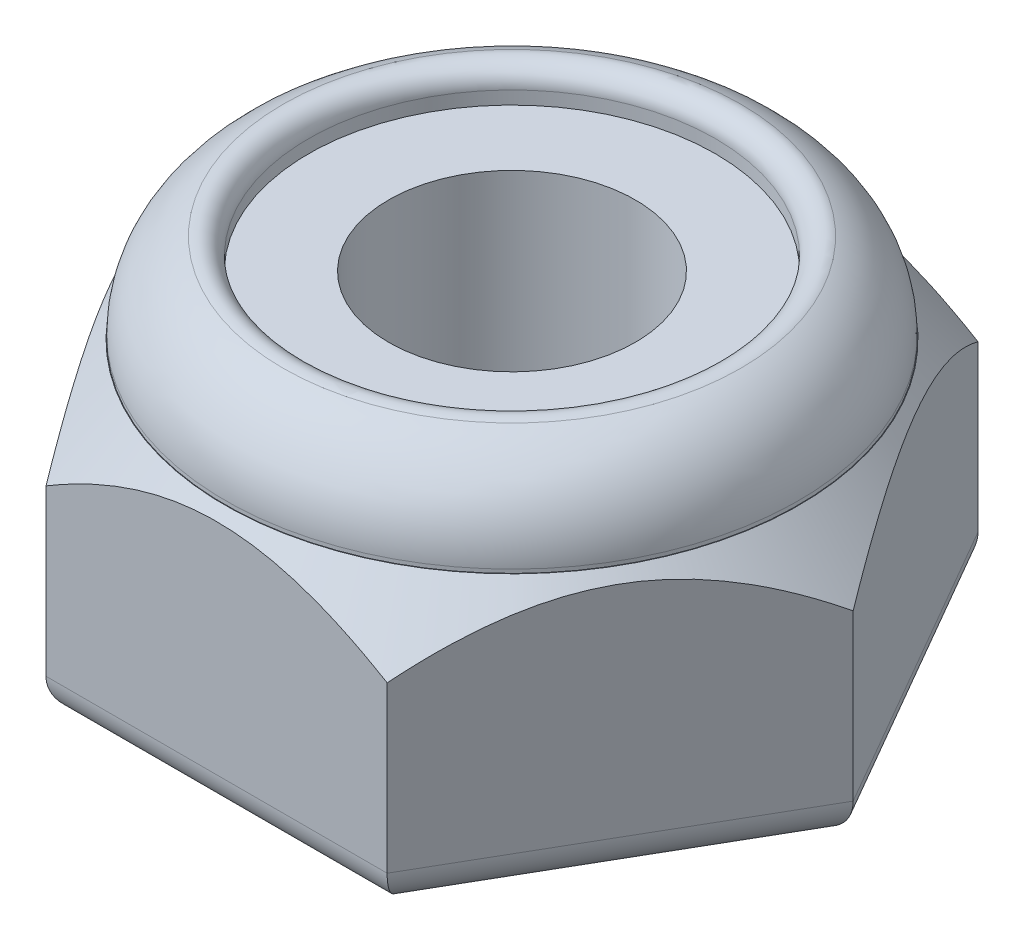
ISO-10303-21;
HEADER;
FILE_DESCRIPTION(('STEP AP214'),'2;1');
FILE_NAME('part.step','',(''),(''),'','','');
FILE_SCHEMA(('AUTOMOTIVE_DESIGN { 1 0 10303 214 1 1 1 1 }'));
ENDSEC;
DATA;
#1=APPLICATION_CONTEXT('core data for automotive mechanical design processes');
#2=APPLICATION_PROTOCOL_DEFINITION('international standard','automotive_design',2000,#1);
#3=PRODUCT_CONTEXT('',#1,'mechanical');
#4=PRODUCT('Part','Part','',(#3));
#5=PRODUCT_RELATED_PRODUCT_CATEGORY('part','',(#4));
#6=PRODUCT_DEFINITION_FORMATION('','',#4);
#7=PRODUCT_DEFINITION_CONTEXT('part definition',#1,'design');
#8=PRODUCT_DEFINITION('design','',#6,#7);
#9=PRODUCT_DEFINITION_SHAPE('','',#8);
#10=(LENGTH_UNIT() NAMED_UNIT(*) SI_UNIT(.MILLI.,.METRE.));
#11=(NAMED_UNIT(*) PLANE_ANGLE_UNIT() SI_UNIT($,.RADIAN.));
#12=(NAMED_UNIT(*) SI_UNIT($,.STERADIAN.) SOLID_ANGLE_UNIT());
#13=UNCERTAINTY_MEASURE_WITH_UNIT(LENGTH_MEASURE(1.E-05),#10,'distance_accuracy_value','');
#14=(GEOMETRIC_REPRESENTATION_CONTEXT(3) GLOBAL_UNCERTAINTY_ASSIGNED_CONTEXT((#13)) GLOBAL_UNIT_ASSIGNED_CONTEXT((#10,
#11,#12)) REPRESENTATION_CONTEXT('',''));
#15=CARTESIAN_POINT('',(0.,0.,0.));
#16=DIRECTION('',(0.,0.,1.));
#17=DIRECTION('',(1.,0.,0.));
#18=AXIS2_PLACEMENT_3D('',#15,#16,#17);
#19=CARTESIAN_POINT('',(0.,4.9784,0.));
#20=DIRECTION('',(0.,-1.,0.));
#21=DIRECTION('',(0.,0.,-1.));
#22=AXIS2_PLACEMENT_3D('',#19,#20,#21);
#23=CYLINDRICAL_SURFACE('',#22,3.937);
#24=CARTESIAN_POINT('',(0.,3.7084,0.));
#25=DIRECTION('',(0.,1.,0.));
#26=DIRECTION('',(0.,0.,-1.));
#27=AXIS2_PLACEMENT_3D('',#24,#25,#26);
#28=CIRCLE('',#27,3.937);
#29=CARTESIAN_POINT('',(0.,3.7084,-3.937));
#30=VERTEX_POINT('',#29);
#31=EDGE_CURVE('E320',#30,#30,#28,.T.);
#32=ORIENTED_EDGE('',*,*,#31,.F.);
#33=EDGE_LOOP('',(#32));
#34=FACE_BOUND('',#33,.T.);
#35=CARTESIAN_POINT('',(0.,3.6575999992,0.));
#36=DIRECTION('',(0.,-1.,0.));
#37=DIRECTION('',(0.,0.,-1.));
#38=AXIS2_PLACEMENT_3D('',#35,#36,#37);
#39=CIRCLE('',#38,3.937);
#40=CARTESIAN_POINT('',(0.,3.6575999992,-3.937));
#41=VERTEX_POINT('',#40);
#42=EDGE_CURVE('E20',#41,#41,#39,.F.);
#43=ORIENTED_EDGE('',*,*,#42,.T.);
#44=EDGE_LOOP('',(#43));
#45=FACE_BOUND('',#44,.T.);
#46=ADVANCED_FACE('F17',(#34,#45),#23,.T.);
#47=CARTESIAN_POINT('',(0.,3.7084,0.));
#48=DIRECTION('',(0.,1.,0.));
#49=DIRECTION('',(0.,0.,-1.));
#50=AXIS2_PLACEMENT_3D('',#47,#48,#49);
#51=TOROIDAL_SURFACE('',#50,2.667,1.27);
#52=ORIENTED_EDGE('',*,*,#31,.T.);
#53=EDGE_LOOP('',(#52));
#54=FACE_BOUND('',#53,.T.);
#55=CARTESIAN_POINT('',(0.,4.88572150982595,0.));
#56=DIRECTION('',(0.,-1.,0.));
#57=DIRECTION('',(0.,0.,1.));
#58=AXIS2_PLACEMENT_3D('',#55,#56,#57);
#59=CIRCLE('',#58,3.14324999999836);
#60=CARTESIAN_POINT('',(0.,4.88572150982595,3.14324999999836));
#61=VERTEX_POINT('',#60);
#62=EDGE_CURVE('E321',#61,#61,#59,.F.);
#63=ORIENTED_EDGE('',*,*,#62,.F.);
#64=EDGE_LOOP('',(#63));
#65=FACE_BOUND('',#64,.T.);
#66=ADVANCED_FACE('F135',(#54,#65),#51,.T.);
#67=CARTESIAN_POINT('',(2.34315,3.6576,4.05845484976));
#68=DIRECTION('',(0.,-1.,0.));
#69=DIRECTION('',(0.,0.,-1.));
#70=AXIS2_PLACEMENT_3D('',#67,#68,#69);
#71=PLANE('',#70);
#72=ORIENTED_EDGE('',*,*,#42,.F.);
#73=EDGE_LOOP('',(#72));
#74=FACE_BOUND('',#73,.T.);
#75=CARTESIAN_POINT('',(0.,3.65759999999682,0.));
#76=DIRECTION('',(0.,-1.,0.));
#77=DIRECTION('',(0.,0.,-1.));
#78=AXIS2_PLACEMENT_3D('',#75,#76,#77);
#79=CIRCLE('',#78,3.94407100941407);
#80=CARTESIAN_POINT('',(0.,3.65759999999682,-3.94407100941407));
#81=VERTEX_POINT('',#80);
#82=EDGE_CURVE('E120',#81,#81,#79,.T.);
#83=ORIENTED_EDGE('',*,*,#82,.F.);
#84=EDGE_LOOP('',(#83));
#85=FACE_BOUND('',#84,.T.);
#86=ADVANCED_FACE('F130',(#74,#85),#71,.F.);
#87=CARTESIAN_POINT('',(0.,4.65025720786,0.));
#88=DIRECTION('',(0.,-1.,0.));
#89=DIRECTION('',(0.,0.,1.));
#90=AXIS2_PLACEMENT_3D('',#87,#88,#89);
#91=TOROIDAL_SURFACE('',#90,3.048,0.254);
#92=CARTESIAN_POINT('',(0.,4.65025720786,0.));
#93=DIRECTION('',(0.,1.,0.));
#94=DIRECTION('',(0.,0.,1.));
#95=AXIS2_PLACEMENT_3D('',#92,#93,#94);
#96=CIRCLE('',#95,2.794);
#97=CARTESIAN_POINT('',(0.,4.65025720786,2.794));
#98=VERTEX_POINT('',#97);
#99=EDGE_CURVE('E105',#98,#98,#96,.F.);
#100=ORIENTED_EDGE('',*,*,#99,.T.);
#101=EDGE_LOOP('',(#100));
#102=FACE_BOUND('',#101,.T.);
#103=ORIENTED_EDGE('',*,*,#62,.T.);
#104=EDGE_LOOP('',(#103));
#105=FACE_BOUND('',#104,.T.);
#106=ADVANCED_FACE('F126',(#102,#105),#91,.T.);
#107=CARTESIAN_POINT('',(0.,2.76773860952062,0.));
#108=DIRECTION('',(0.,-1.,0.));
#109=DIRECTION('',(0.,0.,-1.));
#110=AXIS2_PLACEMENT_3D('',#107,#108,#109);
#111=CONICAL_SURFACE('',#110,4.69075337400682,0.698131700827581);
#112=CARTESIAN_POINT('',(-4.68629999991666,2.77304593410457,1.4434590500557E-10));
#113=CARTESIAN_POINT('',(-4.6517771713124,2.81418235899681,0.0597952933078886));
#114=CARTESIAN_POINT('',(-4.61695780278158,2.85432113120468,0.120104208690698));
#115=CARTESIAN_POINT('',(-4.54666264430625,2.93230661029137,0.241858994696012));
#116=CARTESIAN_POINT('',(-4.51118655183911,2.97015222469558,0.303305389303076));
#117=CARTESIAN_POINT('',(-4.40329561875201,3.08018701505636,0.490177967085855));
#118=CARTESIAN_POINT('',(-4.3298333399457,3.14837015580251,0.61741836641811));
#119=CARTESIAN_POINT('',(-4.17977964988124,3.27092778610743,0.877318981472815));
#120=CARTESIAN_POINT('',(-4.1031794392369,3.32525984886549,1.00999443817922));
#121=CARTESIAN_POINT('',(-3.94747591643516,3.41577217643516,1.27968085058917));
#122=CARTESIAN_POINT('',(-3.86837998236468,3.45200143009599,1.41667902707128));
#123=CARTESIAN_POINT('',(-3.73746585189115,3.493728112384,1.64342895248002));
#124=CARTESIAN_POINT('',(-3.68614686012057,3.50560413709795,1.73231605361984));
#125=CARTESIAN_POINT('',(-3.58316406700401,3.52008140696403,1.91068748360297));
#126=CARTESIAN_POINT('',(-3.53150020825549,3.52268106746167,2.00017191187044));
#127=CARTESIAN_POINT('',(-3.42855034541907,3.51847006516773,2.17848630493527));
#128=CARTESIAN_POINT('',(-3.37726380875734,3.51171021109729,2.26731719217758));
#129=CARTESIAN_POINT('',(-3.27519197698713,3.48921023545692,2.44411079082512));
#130=CARTESIAN_POINT('',(-3.22440670704505,3.47346966531413,2.53207345864086));
#131=CARTESIAN_POINT('',(-3.10963060122696,3.42817062210254,2.7308715054126));
#132=CARTESIAN_POINT('',(-3.04589899564457,3.39598542063136,2.84125788432917));
#133=CARTESIAN_POINT('',(-2.92018166725232,3.32004827830917,3.05900668449626));
#134=CARTESIAN_POINT('',(-2.85819691946939,3.27629001398473,3.16636741695058));
#135=CARTESIAN_POINT('',(-2.73588906813006,3.17910361367827,3.37821082963477));
#136=CARTESIAN_POINT('',(-2.67557364720568,3.12563730711488,3.48268020315565));
#137=CARTESIAN_POINT('',(-2.55683004301376,3.01104764586175,3.6883501586898));
#138=CARTESIAN_POINT('',(-2.49840123069798,2.94992687724908,3.7895518302466));
#139=CARTESIAN_POINT('',(-2.42439626075924,2.86741854603678,3.91773219819303));
#140=CARTESIAN_POINT('',(-2.40802320093963,2.84883596631722,3.94609116967594));
#141=CARTESIAN_POINT('',(-2.37546215758359,2.81125673899581,4.00248855111603));
#142=CARTESIAN_POINT('',(-2.35927376440876,2.79226151158477,4.03052767058773));
#143=CARTESIAN_POINT('',(-2.34315000000343,2.77304593401147,4.05845484974702));
#144=B_SPLINE_CURVE_WITH_KNOTS('',3,(#112,#113,#114,#115,#116,#117,#118,#119,#120,#121,#122,
#123,#124,#125,#126,#127,#128,#129,#130,#131,#132,#133,#134,#135,#136,#137,#138,#139,#140,#141,
#142,#143),.UNSPECIFIED.,.F.,.F.,(4,2,2,2,2,2,2,2,2,2,2,2,2,2,2,4),(0.,0.241096809071769,
0.482307589418999,0.967637153779526,1.4544359223224,1.93991010942664,2.24950193421383,
2.55914664314663,2.86711700063377,3.17510274211015,3.56882084711449,3.9627545240938,
4.35827201942639,4.75365624696984,4.86660838972883,4.97921936867768),.UNSPECIFIED.);
#145=CARTESIAN_POINT('',(-4.68629999995643,2.77304593405718,6.53656963999853E-11));
#146=VERTEX_POINT('',#145);
#147=CARTESIAN_POINT('',(-2.3431499999157,2.77304593405713,4.05845484975342));
#148=VERTEX_POINT('',#147);
#149=EDGE_CURVE('E92',#146,#148,#144,.T.);
#150=ORIENTED_EDGE('',*,*,#149,.T.);
#151=CARTESIAN_POINT('',(-2.34314999982787,2.77304593410268,4.05845484976));
#152=CARTESIAN_POINT('',(-2.27415972147602,2.81414935281112,4.05845484976));
#153=CARTESIAN_POINT('',(-2.20457738499326,2.85425669893359,4.05845484976));
#154=CARTESIAN_POINT('',(-2.06410193505854,2.93218331975122,4.05845484976));
#155=CARTESIAN_POINT('',(-1.99320821619297,2.97000150137744,4.05845484976));
#156=CARTESIAN_POINT('',(-1.77754688751654,3.07999086390864,4.05845484976));
#157=CARTESIAN_POINT('',(-1.63068545849823,3.14815894040016,4.05845484976001));
#158=CARTESIAN_POINT('',(-1.33052752439367,3.27077676919417,4.05845484975999));
#159=CARTESIAN_POINT('',(-1.17720631591642,3.32516696802971,4.05845484975996));
#160=CARTESIAN_POINT('',(-0.865613503651135,3.41574608762602,4.05845484976004));
#161=CARTESIAN_POINT('',(-0.707359229166658,3.45199244870592,4.05845484976014));
#162=CARTESIAN_POINT('',(-0.456822143233253,3.49192146540694,4.05845484975992));
#163=CARTESIAN_POINT('',(-0.365672921066384,3.50290887288614,4.05845484975977));
#164=CARTESIAN_POINT('',(-0.183016321959285,3.51758027905892,4.05845484976023));
#165=CARTESIAN_POINT('',(-0.0915105175025023,3.52128341029266,4.05845484976084));
#166=CARTESIAN_POINT('',(0.104649468639937,3.52128177484029,4.05845484976094));
#167=CARTESIAN_POINT('',(0.209305100869069,3.51643705325766,4.05845484976025));
#168=CARTESIAN_POINT('',(0.417787181904294,3.49730239552369,4.05845484975975));
#169=CARTESIAN_POINT('',(0.52161318134613,3.48300765103988,4.05845484975994));
#170=CARTESIAN_POINT('',(0.728332544904505,3.44553375878898,4.05845484976007));
#171=CARTESIAN_POINT('',(0.831215331548374,3.42229697717018,4.05845484976002));
#172=CARTESIAN_POINT('',(1.03487580389909,3.36791830047904,4.05845484975999));
#173=CARTESIAN_POINT('',(1.1356528946751,3.33677420315167,4.05845484976));
#174=CARTESIAN_POINT('',(1.33273383820699,3.26838741911988,4.05845484976001));
#175=CARTESIAN_POINT('',(1.42908716224489,3.23128582678808,4.05845484976));
#176=CARTESIAN_POINT('',(1.6194729170663,3.15151071586684,4.05845484976));
#177=CARTESIAN_POINT('',(1.71350470708075,3.10883567894396,4.05845484976));
#178=CARTESIAN_POINT('',(1.89803195380597,3.01941532327227,4.05845484976));
#179=CARTESIAN_POINT('',(1.98855798044621,2.97273255721912,4.05845484976));
#180=CARTESIAN_POINT('',(2.16742834956338,2.87556944080918,4.05845484976));
#181=CARTESIAN_POINT('',(2.25577492890631,2.82509321929021,4.05845484976));
#182=CARTESIAN_POINT('',(2.34315000003749,2.7730459339646,4.05845484976));
#183=B_SPLINE_CURVE_WITH_KNOTS('',3,(#151,#152,#153,#154,#155,#156,#157,#158,#159,#160,#161,
#162,#163,#164,#165,#166,#167,#168,#169,#170,#171,#172,#173,#174,#175,#176,#177,#178,#179,#180,
#181,#182),.UNSPECIFIED.,.F.,.F.,(4,2,2,2,2,2,2,2,2,2,2,2,2,2,2,4),(0.,0.240903303540453,
0.48192074469848,0.967059466894678,1.4542606836375,1.93990959161982,2.21507934673806,
2.48952538360679,2.80337599567293,3.11738642330865,3.43345557942433,3.74961286025032,
4.05916118076243,4.36879400588816,4.67425708514019,4.97939238035736),.UNSPECIFIED.);
#184=CARTESIAN_POINT('',(2.34315000000956,2.77304593396416,4.05845484977656));
#185=VERTEX_POINT('',#184);
#186=EDGE_CURVE('E84',#148,#185,#183,.T.);
#187=ORIENTED_EDGE('',*,*,#186,.T.);
#188=CARTESIAN_POINT('',(2.34314999997386,2.77304593396055,4.05845484978657));
#189=CARTESIAN_POINT('',(2.37767282858503,2.81418235886132,3.99865955662288));
#190=CARTESIAN_POINT('',(2.41249219712023,2.85432113107636,3.93835064123749));
#191=CARTESIAN_POINT('',(2.48278735560205,2.93230661017604,3.8165958552247));
#192=CARTESIAN_POINT('',(2.51826344807131,2.97015222458605,3.75514946061274));
#193=CARTESIAN_POINT('',(2.62615438116569,3.08018701496448,3.56827688281535));
#194=CARTESIAN_POINT('',(2.69961665997799,3.1483701557225,3.44103648347369));
#195=CARTESIAN_POINT('',(2.84967035005481,3.27092778604961,3.18113586839831));
#196=CARTESIAN_POINT('',(2.92627056070551,3.32525984881795,3.0484604116806));
#197=CARTESIAN_POINT('',(3.08197408352079,3.41577217640543,2.77877399924704));
#198=CARTESIAN_POINT('',(3.16107001759841,3.45200143007382,2.64177582275261));
#199=CARTESIAN_POINT('',(3.29198414807874,3.49372811236919,2.41502589733214));
#200=CARTESIAN_POINT('',(3.34330313984876,3.50560413708506,2.32613879619329));
#201=CARTESIAN_POINT('',(3.44628593296427,3.5200814069551,2.14776736621195));
#202=CARTESIAN_POINT('',(3.49794979171233,3.52268106745478,2.05828293794531));
#203=CARTESIAN_POINT('',(3.60089965454782,3.51847006516492,1.87996854488208));
#204=CARTESIAN_POINT('',(3.65218619120909,3.51171021109652,1.79113765764055));
#205=CARTESIAN_POINT('',(3.75425802297848,3.48921023546019,1.61434405899444));
#206=CARTESIAN_POINT('',(3.80504329292019,3.47346966531939,1.52638139117934));
#207=CARTESIAN_POINT('',(3.91981939873543,3.42817062211299,1.32758334441255));
#208=CARTESIAN_POINT('',(3.98355100431538,3.39598542064542,1.21719696550019));
#209=CARTESIAN_POINT('',(4.10926833270294,3.32004827833082,0.999448165341223));
#210=CARTESIAN_POINT('',(4.17125308048361,3.27629001401038,0.892087432890815));
#211=CARTESIAN_POINT('',(4.29356093181863,3.17910361371205,0.68024402021408));
#212=CARTESIAN_POINT('',(4.35387635274097,3.12563730715277,0.575774646696749));
#213=CARTESIAN_POINT('',(4.47261995692888,3.01104764590792,0.37010469116954));
#214=CARTESIAN_POINT('',(4.53104876924271,2.94992687729942,0.268903019616131));
#215=CARTESIAN_POINT('',(4.60505373919433,2.86741854607534,0.140722651647388));
#216=CARTESIAN_POINT('',(4.62142679902862,2.84883596633937,0.112363680139043));
#217=CARTESIAN_POINT('',(4.65398784241369,2.81125673898439,0.0559662986486696));
#218=CARTESIAN_POINT('',(4.67017623560288,2.79226151155619,0.0279271791521165));
#219=CARTESIAN_POINT('',(4.68630000002244,2.77304593396535,-3.18227229899157E-11));
#220=B_SPLINE_CURVE_WITH_KNOTS('',3,(#188,#189,#190,#191,#192,#193,#194,#195,#196,#197,#198,
#199,#200,#201,#202,#203,#204,#205,#206,#207,#208,#209,#210,#211,#212,#213,#214,#215,#216,#217,
#218,#219),.UNSPECIFIED.,.F.,.F.,(4,2,2,2,2,2,2,2,2,2,2,2,2,2,2,4),(0.,0.241096809094008,
0.482307589463435,0.967637153869262,1.45443592245891,1.9399101096095,2.249501934394,
2.55914664332411,2.86711700080813,3.17510274228139,3.56882084726899,3.96275452423153,
4.35827201954788,4.75365624707513,4.86660838993504,4.97921936898417),.UNSPECIFIED.);
#221=CARTESIAN_POINT('',(4.68629999998953,2.77304593400457,-5.35825234191027E-11));
#222=VERTEX_POINT('',#221);
#223=EDGE_CURVE('E89',#185,#222,#220,.T.);
#224=ORIENTED_EDGE('',*,*,#223,.T.);
#225=CARTESIAN_POINT('',(4.6863000000114,2.77304593396376,3.86937306649356E-11));
#226=CARTESIAN_POINT('',(4.65177717141053,2.81418235886461,-0.0597952931309419));
#227=CARTESIAN_POINT('',(4.61695780287969,2.8543211310797,-0.120104208518857));
#228=CARTESIAN_POINT('',(4.54666264440115,2.93230661017948,-0.241858994533567));
#229=CARTESIAN_POINT('',(4.51118655193082,2.97015222458953,-0.303305389144923));
#230=CARTESIAN_POINT('',(4.40329561883467,3.08018701496808,-0.49017796694135));
#231=CARTESIAN_POINT('',(4.3298333400232,3.14837015572619,-0.617418366283535));
#232=CARTESIAN_POINT('',(4.17977964994696,3.27092778605346,-0.877318981359357));
#233=CARTESIAN_POINT('',(4.103179439296,3.32525984882188,-1.00999443807697));
#234=CARTESIAN_POINT('',(3.9474759164805,3.41577217640948,-1.27968085051054));
#235=CARTESIAN_POINT('',(3.86837998240291,3.45200143007793,-1.41667902700506));
#236=CARTESIAN_POINT('',(3.73746585192262,3.49372811237334,-1.64342895242554));
#237=CARTESIAN_POINT('',(3.68614686015263,3.50560413708922,-1.73231605356432));
#238=CARTESIAN_POINT('',(3.58316406703719,3.52008140695928,-1.91068748354551));
#239=CARTESIAN_POINT('',(3.53150020828918,3.52268106745897,-2.00017191181209));
#240=CARTESIAN_POINT('',(3.42855034545377,3.51847006516913,-2.17848630487517));
#241=CARTESIAN_POINT('',(3.37726380879254,3.51171021110076,-2.26731719211663));
#242=CARTESIAN_POINT('',(3.27519197702322,3.48921023546447,-2.44411079076261));
#243=CARTESIAN_POINT('',(3.22440670708155,3.4734696653237,-2.53207345857764));
#244=CARTESIAN_POINT('',(3.10963060126643,3.42817062211737,-2.73087150534424));
#245=CARTESIAN_POINT('',(3.04589899568654,3.39598542064985,-2.8412578842565));
#246=CARTESIAN_POINT('',(2.9201816672991,3.32004827833537,-3.05900668441524));
#247=CARTESIAN_POINT('',(2.8581969195185,3.27629001401498,-3.16636741686554));
#248=CARTESIAN_POINT('',(2.73588906818359,3.17910361371677,-3.37821082954207));
#249=CARTESIAN_POINT('',(2.67557364726132,3.12563730715757,-3.4826802030593));
#250=CARTESIAN_POINT('',(2.55683004307352,3.01104764591286,-3.68835015858631));
#251=CARTESIAN_POINT('',(2.49840123075974,2.94992687730443,-3.78955183013963));
#252=CARTESIAN_POINT('',(2.42439626080767,2.86741854607986,-3.91773219810915));
#253=CARTESIAN_POINT('',(2.40802320097288,2.84883596634331,-3.94609116961837));
#254=CARTESIAN_POINT('',(2.37546215758681,2.81125673898716,-4.00248855111046));
#255=CARTESIAN_POINT('',(2.35927376439714,2.79226151155836,-4.03052767060787));
#256=CARTESIAN_POINT('',(2.34314999997709,2.7730459339669,-4.05845484979265));
#257=B_SPLINE_CURVE_WITH_KNOTS('',3,(#225,#226,#227,#228,#229,#230,#231,#232,#233,#234,#235,
#236,#237,#238,#239,#240,#241,#242,#243,#244,#245,#246,#247,#248,#249,#250,#251,#252,#253,#254,
#255,#256),.UNSPECIFIED.,.F.,.F.,(4,2,2,2,2,2,2,2,2,2,2,2,2,2,2,4),(0.,0.241096809094109,
0.482307589463635,0.967637153869672,1.45443592245954,1.93991010961035,2.24950193439461,
2.55914664332448,2.86711700080826,3.17510274228127,3.56882084726846,3.96275452423059,
4.35827201954654,4.7536562470734,4.86660838993678,4.97921936898936),.UNSPECIFIED.);
#258=CARTESIAN_POINT('',(2.34315000000696,2.7730459339659,-4.05845484977637));
#259=VERTEX_POINT('',#258);
#260=EDGE_CURVE('E194',#222,#259,#257,.T.);
#261=ORIENTED_EDGE('',*,*,#260,.T.);
#262=CARTESIAN_POINT('',(2.34315000003454,2.77304593396103,-4.05845484974981));
#263=CARTESIAN_POINT('',(2.27415972168534,2.81414935269011,-4.05845484975624));
#264=CARTESIAN_POINT('',(2.20457738520025,2.85425669882466,-4.05845484975897));
#265=CARTESIAN_POINT('',(2.06410193525636,2.93218331965835,-4.05845484976103));
#266=CARTESIAN_POINT('',(1.99320821638396,2.97000150128854,-4.05845484976036));
#267=CARTESIAN_POINT('',(1.77754688768886,3.07999086383284,-4.05845484975928));
#268=CARTESIAN_POINT('',(1.63068545865968,3.14815894033524,-4.05845484975981));
#269=CARTESIAN_POINT('',(1.33052752453078,3.27077676915049,-4.05845484976019));
#270=CARTESIAN_POINT('',(1.17720631604,3.32516696799627,-4.05845484976004));
#271=CARTESIAN_POINT('',(0.865613503745031,3.41574608760477,-4.05845484975996));
#272=CARTESIAN_POINT('',(0.707359229244379,3.45199244868657,-4.05845484976003));
#273=CARTESIAN_POINT('',(0.456822143285154,3.49192146539843,-4.05845484975999));
#274=CARTESIAN_POINT('',(0.365672921108244,3.50290887288314,-4.05845484975994));
#275=CARTESIAN_POINT('',(0.183016321980474,3.51758027906123,-4.05845484976006));
#276=CARTESIAN_POINT('',(0.0915105175130626,3.52128341029479,-4.05845484976022));
#277=CARTESIAN_POINT('',(-0.104649468639568,3.5212817748417,-4.05845484976025));
#278=CARTESIAN_POINT('',(-0.20930510086824,3.51643705325964,-4.05845484976007));
#279=CARTESIAN_POINT('',(-0.417787181902551,3.49730239552644,-4.05845484975993));
#280=CARTESIAN_POINT('',(-0.521613181343932,3.48300765104285,-4.05845484975998));
#281=CARTESIAN_POINT('',(-0.728332544901563,3.44553375879271,-4.05845484976002));
#282=CARTESIAN_POINT('',(-0.831215331545142,3.42229697717443,-4.05845484976001));
#283=CARTESIAN_POINT('',(-1.03487580389534,3.36791830048447,-4.05845484976));
#284=CARTESIAN_POINT('',(-1.13565289467112,3.33677420315773,-4.05845484976));
#285=CARTESIAN_POINT('',(-1.33273383819868,3.26838741912867,-4.05845484976));
#286=CARTESIAN_POINT('',(-1.42908716223255,3.23128582679923,-4.05845484976));
#287=CARTESIAN_POINT('',(-1.61947291704614,3.1515107158832,-4.05845484976));
#288=CARTESIAN_POINT('',(-1.71350470705681,3.10883567896316,-4.05845484976));
#289=CARTESIAN_POINT('',(-1.89803195377464,3.01941532329752,-4.05845484976));
#290=CARTESIAN_POINT('',(-1.98855798041127,2.97273255724758,-4.05845484976));
#291=CARTESIAN_POINT('',(-2.16742834952148,2.87556944084429,-4.05845484976));
#292=CARTESIAN_POINT('',(-2.25577492886105,2.82509321932877,-4.05845484976));
#293=CARTESIAN_POINT('',(-2.34314999998895,2.77304593400669,-4.05845484976));
#294=B_SPLINE_CURVE_WITH_KNOTS('',3,(#262,#263,#264,#265,#266,#267,#268,#269,#270,#271,#272,
#273,#274,#275,#276,#277,#278,#279,#280,#281,#282,#283,#284,#285,#286,#287,#288,#289,#290,#291,
#292,#293),.UNSPECIFIED.,.F.,.F.,(4,2,2,2,2,2,2,2,2,2,2,2,2,2,2,4),(0.,0.240903303564568,
0.481920744746104,0.967059466986234,1.45426068377659,1.93990959180789,2.21507934695801,
2.48952538385827,2.80337599592313,3.11738642355736,3.43345557967187,3.74961286049666,
4.05916118099498,4.36879400610686,4.67425708534489,4.97939238054819),.UNSPECIFIED.);
#295=CARTESIAN_POINT('',(-2.34315000003672,2.77304593405505,-4.05845484968556));
#296=VERTEX_POINT('',#295);
#297=EDGE_CURVE('E204',#259,#296,#294,.T.);
#298=ORIENTED_EDGE('',*,*,#297,.T.);
#299=CARTESIAN_POINT('',(-2.34315000008595,2.77304593410254,-4.05845484961112));
#300=CARTESIAN_POINT('',(-2.37767282869018,2.81418235899467,-3.99865955644765));
#301=CARTESIAN_POINT('',(-2.41249219722096,2.85432113120243,-3.9383506410649));
#302=CARTESIAN_POINT('',(-2.48278735569621,2.93230661028892,-3.81659585505972));
#303=CARTESIAN_POINT('',(-2.51826344816331,2.97015222469302,-3.75514946045272));
#304=CARTESIAN_POINT('',(-2.62615438125029,3.08018701505349,-3.56827688267016));
#305=CARTESIAN_POINT('',(-2.69961666005651,3.14837015579945,-3.44103648333806));
#306=CARTESIAN_POINT('',(-2.84967035012078,3.27092778610399,-3.18113586828368));
#307=CARTESIAN_POINT('',(-2.92627056076501,3.32525984886188,-3.04846041157745));
#308=CARTESIAN_POINT('',(-3.08197408356654,3.41577217643126,-2.77877399916788));
#309=CARTESIAN_POINT('',(-3.1610700176369,3.45200143009197,-2.64177582268597));
#310=CARTESIAN_POINT('',(-3.29198414811035,3.49372811237989,-2.41502589727738));
#311=CARTESIAN_POINT('',(-3.34330313988097,3.50560413709382,-2.32613879613749));
#312=CARTESIAN_POINT('',(-3.4462859329976,3.52008140695987,-2.14776736615423));
#313=CARTESIAN_POINT('',(-3.49794979174616,3.52268106745749,-2.05828293788671));
#314=CARTESIAN_POINT('',(-3.60089965458265,3.51847006516349,-1.87996854482175));
#315=CARTESIAN_POINT('',(-3.65218619124441,3.51171021109302,-1.79113765757938));
#316=CARTESIAN_POINT('',(-3.7542580230147,3.48921023545259,-1.61434405893171));
#317=CARTESIAN_POINT('',(-3.80504329295681,3.47346966530978,-1.52638139111591));
#318=CARTESIAN_POINT('',(-3.91981939877501,3.4281706220981,-1.327583344344));
#319=CARTESIAN_POINT('',(-3.98355100435746,3.39598542062686,-1.2171969654273));
#320=CARTESIAN_POINT('',(-4.10926833274984,3.32004827830454,-0.999448165259983));
#321=CARTESIAN_POINT('',(-4.17125308053284,3.27629001398003,-0.892087432805545));
#322=CARTESIAN_POINT('',(-4.2935609318723,3.17910361367342,-0.680244020121134));
#323=CARTESIAN_POINT('',(-4.35387635279674,3.12563730710995,-0.575774646600153));
#324=CARTESIAN_POINT('',(-4.47261995698877,3.01104764585666,-0.3701046910658));
#325=CARTESIAN_POINT('',(-4.53104876930462,2.94992687724391,-0.268903019508897));
#326=CARTESIAN_POINT('',(-4.60505373924291,2.86741854603208,-0.140722651563232));
#327=CARTESIAN_POINT('',(-4.62142679906203,2.84883596631308,-0.112363680081174));
#328=CARTESIAN_POINT('',(-4.6539878424171,2.81125673899282,-0.0559662986427702));
#329=CARTESIAN_POINT('',(-4.67017623559145,2.79226151158236,-0.0279271791719031));
#330=CARTESIAN_POINT('',(-4.6862999999963,2.77304593400966,-1.34435336237376E-11));
#331=B_SPLINE_CURVE_WITH_KNOTS('',3,(#299,#300,#301,#302,#303,#304,#305,#306,#307,#308,#309,
#310,#311,#312,#313,#314,#315,#316,#317,#318,#319,#320,#321,#322,#323,#324,#325,#326,#327,#328,
#329,#330),.UNSPECIFIED.,.F.,.F.,(4,2,2,2,2,2,2,2,2,2,2,2,2,2,2,4),(0.,0.241096809071417,
0.482307589418293,0.967637153778091,1.45443592232021,1.93991010942371,2.24950193421111,
2.55914664314412,2.86711700063149,3.17510274210808,3.56882084711286,3.96275452409262,
4.35827201942563,4.75365624696951,4.8666083897251,4.97921936867056),.UNSPECIFIED.);
#332=EDGE_CURVE('E252',#296,#146,#331,.T.);
#333=ORIENTED_EDGE('',*,*,#332,.T.);
#334=EDGE_LOOP('',(#150,#187,#224,#261,#298,#333));
#335=FACE_BOUND('',#334,.T.);
#336=ORIENTED_EDGE('',*,*,#82,.T.);
#337=EDGE_LOOP('',(#336));
#338=FACE_BOUND('',#337,.T.);
#339=ADVANCED_FACE('F86',(#335,#338),#111,.T.);
#340=CARTESIAN_POINT('',(0.,4.4704,0.));
#341=DIRECTION('',(0.,1.,0.));
#342=DIRECTION('',(0.,0.,1.));
#343=AXIS2_PLACEMENT_3D('',#340,#341,#342);
#344=CYLINDRICAL_SURFACE('',#343,2.794);
#345=ORIENTED_EDGE('',*,*,#99,.F.);
#346=EDGE_LOOP('',(#345));
#347=FACE_BOUND('',#346,.T.);
#348=CARTESIAN_POINT('',(0.,4.4704,0.));
#349=DIRECTION('',(0.,1.,0.));
#350=DIRECTION('',(0.,0.,1.));
#351=AXIS2_PLACEMENT_3D('',#348,#349,#350);
#352=CIRCLE('',#351,2.794);
#353=CARTESIAN_POINT('',(0.,4.4704,2.794));
#354=VERTEX_POINT('',#353);
#355=EDGE_CURVE('E202',#354,#354,#352,.T.);
#356=ORIENTED_EDGE('',*,*,#355,.F.);
#357=EDGE_LOOP('',(#356));
#358=FACE_BOUND('',#357,.T.);
#359=ADVANCED_FACE('F212',(#347,#358),#344,.F.);
#360=CARTESIAN_POINT('',(2.34315,3.6576,4.05845484976));
#361=DIRECTION('',(-0.866025403784329,0.,-0.50000000000019));
#362=DIRECTION('',(-0.50000000000019,0.,0.866025403784329));
#363=AXIS2_PLACEMENT_3D('',#360,#361,#362);
#364=PLANE('',#363);
#365=DIRECTION('',(-0.50000000000019,0.,0.866025403784329));
#366=VECTOR('',#365,1.);
#367=CARTESIAN_POINT('',(2.34315000000244,0.508,4.0584548497601));
#368=LINE('',#367,#366);
#369=CARTESIAN_POINT('',(4.68629999998101,0.508,-3.61285023998462E-11));
#370=VERTEX_POINT('',#369);
#371=CARTESIAN_POINT('',(2.34315000000125,0.508,4.05845484976));
#372=VERTEX_POINT('',#371);
#373=EDGE_CURVE('E244',#370,#372,#368,.T.);
#374=ORIENTED_EDGE('',*,*,#373,.F.);
#375=DIRECTION('',(0.,1.,0.));
#376=VECTOR('',#375,1.);
#377=CARTESIAN_POINT('',(4.68629999995656,3.6576,-7.52376863406847E-11));
#378=LINE('',#377,#376);
#379=EDGE_CURVE('E103',#370,#222,#378,.T.);
#380=ORIENTED_EDGE('',*,*,#379,.T.);
#381=ORIENTED_EDGE('',*,*,#223,.F.);
#382=DIRECTION('',(0.,1.,0.));
#383=VECTOR('',#382,1.);
#384=CARTESIAN_POINT('',(2.34315,3.6576,4.05845484976));
#385=LINE('',#384,#383);
#386=EDGE_CURVE('E96',#185,#372,#385,.F.);
#387=ORIENTED_EDGE('',*,*,#386,.T.);
#388=EDGE_LOOP('',(#374,#380,#381,#387));
#389=FACE_BOUND('',#388,.T.);
#390=ADVANCED_FACE('F100',(#389),#364,.F.);
#391=CARTESIAN_POINT('',(-2.34315,3.6576,4.05845484976));
#392=DIRECTION('',(0.,0.,-1.));
#393=DIRECTION('',(-1.,0.,0.));
#394=AXIS2_PLACEMENT_3D('',#391,#392,#393);
#395=PLANE('',#394);
#396=DIRECTION('',(-1.,0.,0.));
#397=VECTOR('',#396,1.);
#398=CARTESIAN_POINT('',(-2.34315,0.508,4.05845484976));
#399=LINE('',#398,#397);
#400=CARTESIAN_POINT('',(-2.34314999995443,0.508,4.05845484983513));
#401=VERTEX_POINT('',#400);
#402=EDGE_CURVE('E110',#372,#401,#399,.T.);
#403=ORIENTED_EDGE('',*,*,#402,.F.);
#404=ORIENTED_EDGE('',*,*,#386,.F.);
#405=ORIENTED_EDGE('',*,*,#186,.F.);
#406=DIRECTION('',(0.,1.,0.));
#407=VECTOR('',#406,1.);
#408=CARTESIAN_POINT('',(-2.3431499999095,3.6576,4.05845484990971));
#409=LINE('',#408,#407);
#410=EDGE_CURVE('E113',#148,#401,#409,.F.);
#411=ORIENTED_EDGE('',*,*,#410,.T.);
#412=EDGE_LOOP('',(#403,#404,#405,#411));
#413=FACE_BOUND('',#412,.T.);
#414=ADVANCED_FACE('F108',(#413),#395,.F.);
#415=CARTESIAN_POINT('',(-4.6863,3.6576,0.));
#416=DIRECTION('',(0.866025403784329,0.,-0.50000000000019));
#417=DIRECTION('',(-0.50000000000019,0.,-0.866025403784329));
#418=AXIS2_PLACEMENT_3D('',#415,#416,#417);
#419=PLANE('',#418);
#420=DIRECTION('',(-0.50000000000019,0.,-0.866025403784329));
#421=VECTOR('',#420,1.);
#422=CARTESIAN_POINT('',(-4.68630000000244,0.508,0.));
#423=LINE('',#422,#421);
#424=CARTESIAN_POINT('',(-4.68630000004847,0.508,7.36768637635624E-11));
#425=VERTEX_POINT('',#424);
#426=EDGE_CURVE('E284',#401,#425,#423,.T.);
#427=ORIENTED_EDGE('',*,*,#426,.F.);
#428=ORIENTED_EDGE('',*,*,#410,.F.);
#429=ORIENTED_EDGE('',*,*,#149,.F.);
#430=DIRECTION('',(0.,1.,0.));
#431=VECTOR('',#430,1.);
#432=CARTESIAN_POINT('',(-4.68630000009149,3.6576,1.51414471238898E-10));
#433=LINE('',#432,#431);
#434=EDGE_CURVE('E251',#146,#425,#433,.F.);
#435=ORIENTED_EDGE('',*,*,#434,.T.);
#436=EDGE_LOOP('',(#427,#428,#429,#435));
#437=FACE_BOUND('',#436,.T.);
#438=ADVANCED_FACE('F229',(#437),#419,.F.);
#439=CARTESIAN_POINT('',(-2.34315,3.6576,-4.05845484976));
#440=DIRECTION('',(0.866025403784329,0.,0.50000000000019));
#441=DIRECTION('',(0.50000000000019,0.,-0.866025403784329));
#442=AXIS2_PLACEMENT_3D('',#439,#440,#441);
#443=PLANE('',#442);
#444=DIRECTION('',(0.50000000000019,0.,-0.866025403784329));
#445=VECTOR('',#444,1.);
#446=CARTESIAN_POINT('',(-2.34315000000244,0.508,-4.0584548497601));
#447=LINE('',#446,#445);
#448=CARTESIAN_POINT('',(-2.34315000009125,0.508,-4.05845484976));
#449=VERTEX_POINT('',#448);
#450=EDGE_CURVE('E272',#425,#449,#447,.T.);
#451=ORIENTED_EDGE('',*,*,#450,.F.);
#452=ORIENTED_EDGE('',*,*,#434,.F.);
#453=ORIENTED_EDGE('',*,*,#332,.F.);
#454=DIRECTION('',(0.,1.,0.));
#455=VECTOR('',#454,1.);
#456=CARTESIAN_POINT('',(-2.34315000018,3.6576,-4.05845484976));
#457=LINE('',#456,#455);
#458=EDGE_CURVE('E201',#296,#449,#457,.F.);
#459=ORIENTED_EDGE('',*,*,#458,.T.);
#460=EDGE_LOOP('',(#451,#452,#453,#459));
#461=FACE_BOUND('',#460,.T.);
#462=ADVANCED_FACE('F261',(#461),#443,.F.);
#463=CARTESIAN_POINT('',(2.34315,3.6576,-4.05845484976));
#464=DIRECTION('',(0.,0.,1.));
#465=DIRECTION('',(1.,0.,0.));
#466=AXIS2_PLACEMENT_3D('',#463,#464,#465);
#467=PLANE('',#466);
#468=DIRECTION('',(1.,0.,0.));
#469=VECTOR('',#468,1.);
#470=CARTESIAN_POINT('',(2.34315,0.508,-4.05845484976));
#471=LINE('',#470,#469);
#472=CARTESIAN_POINT('',(2.34314999999769,0.508,-4.05845484975956));
#473=VERTEX_POINT('',#472);
#474=EDGE_CURVE('E302',#449,#473,#471,.T.);
#475=ORIENTED_EDGE('',*,*,#474,.F.);
#476=ORIENTED_EDGE('',*,*,#458,.F.);
#477=ORIENTED_EDGE('',*,*,#297,.F.);
#478=DIRECTION('',(0.,1.,0.));
#479=VECTOR('',#478,1.);
#480=CARTESIAN_POINT('',(2.34314999999695,3.6576,-4.05845484975824));
#481=LINE('',#480,#479);
#482=EDGE_CURVE('E200',#259,#473,#481,.F.);
#483=ORIENTED_EDGE('',*,*,#482,.T.);
#484=EDGE_LOOP('',(#475,#476,#477,#483));
#485=FACE_BOUND('',#484,.T.);
#486=ADVANCED_FACE('F189',(#485),#467,.F.);
#487=CARTESIAN_POINT('',(4.6863,3.6576,0.));
#488=DIRECTION('',(-0.866025403784329,0.,0.50000000000019));
#489=DIRECTION('',(0.50000000000019,0.,0.866025403784329));
#490=AXIS2_PLACEMENT_3D('',#487,#488,#489);
#491=PLANE('',#490);
#492=DIRECTION('',(0.50000000000019,0.,0.866025403784329));
#493=VECTOR('',#492,1.);
#494=CARTESIAN_POINT('',(4.68630000000244,0.508,0.));
#495=LINE('',#494,#493);
#496=EDGE_CURVE('E311',#473,#370,#495,.T.);
#497=ORIENTED_EDGE('',*,*,#496,.F.);
#498=ORIENTED_EDGE('',*,*,#482,.F.);
#499=ORIENTED_EDGE('',*,*,#260,.F.);
#500=ORIENTED_EDGE('',*,*,#379,.F.);
#501=EDGE_LOOP('',(#497,#498,#499,#500));
#502=FACE_BOUND('',#501,.T.);
#503=ADVANCED_FACE('F184',(#502),#491,.F.);
#504=CARTESIAN_POINT('',(0.,4.4704,0.));
#505=DIRECTION('',(0.,1.,0.));
#506=DIRECTION('',(0.,0.,1.));
#507=AXIS2_PLACEMENT_3D('',#504,#505,#506);
#508=PLANE('',#507);
#509=CARTESIAN_POINT('',(0.,4.47039999999,0.));
#510=DIRECTION('',(0.,1.,0.));
#511=DIRECTION('',(0.,0.,1.));
#512=AXIS2_PLACEMENT_3D('',#509,#510,#511);
#513=CIRCLE('',#512,1.69545);
#514=CARTESIAN_POINT('',(0.,4.47039999999,1.69545));
#515=VERTEX_POINT('',#514);
#516=EDGE_CURVE('E306',#515,#515,#513,.F.);
#517=ORIENTED_EDGE('',*,*,#516,.T.);
#518=EDGE_LOOP('',(#517));
#519=FACE_BOUND('',#518,.T.);
#520=ORIENTED_EDGE('',*,*,#355,.T.);
#521=EDGE_LOOP('',(#520));
#522=FACE_BOUND('',#521,.T.);
#523=ADVANCED_FACE('F180',(#519,#522),#508,.T.);
#524=CARTESIAN_POINT('',(1.90320909488,0.508,3.80445484976));
#525=DIRECTION('',(-0.50000000000019,0.,0.866025403784329));
#526=DIRECTION('',(0.866025403784329,0.,0.50000000000019));
#527=AXIS2_PLACEMENT_3D('',#524,#525,#526);
#528=CYLINDRICAL_SURFACE('',#527,0.508);
#529=CARTESIAN_POINT('',(2.04985606325424,0.508,3.55045484976));
#530=DIRECTION('',(-0.866025403784494,0.,0.499999999999905));
#531=DIRECTION('',(-0.499999999999905,0.,-0.866025403784494));
#532=AXIS2_PLACEMENT_3D('',#529,#530,#531);
#533=ELLIPSE('',#532,0.586587873496623,0.508);
#534=CARTESIAN_POINT('',(2.04985606375794,0.,3.55045485041748));
#535=VERTEX_POINT('',#534);
#536=EDGE_CURVE('E245',#535,#372,#533,.T.);
#537=ORIENTED_EDGE('',*,*,#536,.F.);
#538=DIRECTION('',(-0.499999999989813,0.,0.86602540379032));
#539=VECTOR('',#538,1.);
#540=CARTESIAN_POINT('',(4.0997121268,0.,9.29084066625396E-10));
#541=LINE('',#540,#539);
#542=CARTESIAN_POINT('',(4.09971212706719,0.,4.66302235539728E-10));
#543=VERTEX_POINT('',#542);
#544=EDGE_CURVE('E297',#543,#535,#541,.T.);
#545=ORIENTED_EDGE('',*,*,#544,.F.);
#546=CARTESIAN_POINT('',(4.09971212650779,0.508,3.52040445406043E-12));
#547=DIRECTION('',(0.,0.,1.));
#548=DIRECTION('',(1.,0.,0.));
#549=AXIS2_PLACEMENT_3D('',#546,#547,#548);
#550=ELLIPSE('',#549,0.586587873496734,0.508);
#551=EDGE_CURVE('E313',#370,#543,#550,.F.);
#552=ORIENTED_EDGE('',*,*,#551,.F.);
#553=ORIENTED_EDGE('',*,*,#373,.T.);
#554=EDGE_LOOP('',(#537,#545,#552,#553));
#555=FACE_BOUND('',#554,.T.);
#556=ADVANCED_FACE('F176',(#555),#528,.T.);
#557=CARTESIAN_POINT('',(-2.34315,0.508,3.55045484976));
#558=DIRECTION('',(-1.,0.,0.));
#559=DIRECTION('',(0.,0.,1.));
#560=AXIS2_PLACEMENT_3D('',#557,#558,#559);
#561=CYLINDRICAL_SURFACE('',#560,0.508);
#562=ORIENTED_EDGE('',*,*,#536,.T.);
#563=ORIENTED_EDGE('',*,*,#402,.T.);
#564=CARTESIAN_POINT('',(-2.04985606325017,0.508,3.55045484976));
#565=DIRECTION('',(-0.866025403784493,0.,-0.499999999999905));
#566=DIRECTION('',(0.499999999999905,0.,-0.866025403784493));
#567=AXIS2_PLACEMENT_3D('',#564,#565,#566);
#568=ELLIPSE('',#567,0.586587873496623,0.508);
#569=CARTESIAN_POINT('',(-2.04985606378386,0.,3.55045485031));
#570=VERTEX_POINT('',#569);
#571=EDGE_CURVE('E286',#570,#401,#568,.T.);
#572=ORIENTED_EDGE('',*,*,#571,.F.);
#573=DIRECTION('',(1.,0.,0.));
#574=VECTOR('',#573,1.);
#575=CARTESIAN_POINT('',(2.34315,0.,3.55045485031));
#576=LINE('',#575,#574);
#577=EDGE_CURVE('E294',#535,#570,#576,.F.);
#578=ORIENTED_EDGE('',*,*,#577,.F.);
#579=EDGE_LOOP('',(#562,#563,#572,#578));
#580=FACE_BOUND('',#579,.T.);
#581=ADVANCED_FACE('F172',(#580),#561,.T.);
#582=CARTESIAN_POINT('',(-4.24635909488,0.508,-0.254));
#583=DIRECTION('',(-0.50000000000019,0.,-0.866025403784329));
#584=DIRECTION('',(-0.866025403784329,0.,0.50000000000019));
#585=AXIS2_PLACEMENT_3D('',#582,#583,#584);
#586=CYLINDRICAL_SURFACE('',#585,0.508);
#587=ORIENTED_EDGE('',*,*,#571,.T.);
#588=ORIENTED_EDGE('',*,*,#426,.T.);
#589=CARTESIAN_POINT('',(-4.09971212650779,0.508,-3.52081102987511E-12));
#590=DIRECTION('',(0.,0.,-1.));
#591=DIRECTION('',(1.,0.,0.));
#592=AXIS2_PLACEMENT_3D('',#589,#590,#591);
#593=ELLIPSE('',#592,0.586587873496734,0.508);
#594=CARTESIAN_POINT('',(-4.09971212671078,0.,4.62781627797761E-10));
#595=VERTEX_POINT('',#594);
#596=EDGE_CURVE('E277',#595,#425,#593,.T.);
#597=ORIENTED_EDGE('',*,*,#596,.F.);
#598=DIRECTION('',(-0.499999999989813,0.,-0.86602540379032));
#599=VECTOR('',#598,1.);
#600=CARTESIAN_POINT('',(-2.049856064,0.,3.55045485031));
#601=LINE('',#600,#599);
#602=EDGE_CURVE('E296',#570,#595,#601,.T.);
#603=ORIENTED_EDGE('',*,*,#602,.F.);
#604=EDGE_LOOP('',(#587,#588,#597,#603));
#605=FACE_BOUND('',#604,.T.);
#606=ADVANCED_FACE('F168',(#605),#586,.T.);
#607=CARTESIAN_POINT('',(-1.90320909488,0.508,-3.80445484976));
#608=DIRECTION('',(0.50000000000019,0.,-0.866025403784329));
#609=DIRECTION('',(-0.866025403784329,0.,-0.50000000000019));
#610=AXIS2_PLACEMENT_3D('',#607,#608,#609);
#611=CYLINDRICAL_SURFACE('',#610,0.508);
#612=ORIENTED_EDGE('',*,*,#596,.T.);
#613=ORIENTED_EDGE('',*,*,#450,.T.);
#614=CARTESIAN_POINT('',(-2.04985606325424,0.508,-3.55045484976));
#615=DIRECTION('',(0.866025403784494,0.,-0.499999999999905));
#616=DIRECTION('',(0.499999999999905,0.,0.866025403784494));
#617=AXIS2_PLACEMENT_3D('',#614,#615,#616);
#618=ELLIPSE('',#617,0.586587873496623,0.508);
#619=CARTESIAN_POINT('',(-2.04985606367884,0.,-3.55045485049542));
#620=VERTEX_POINT('',#619);
#621=EDGE_CURVE('E276',#620,#449,#618,.T.);
#622=ORIENTED_EDGE('',*,*,#621,.F.);
#623=DIRECTION('',(0.499999999793553,0.,-0.866025403903631));
#624=VECTOR('',#623,1.);
#625=CARTESIAN_POINT('',(-4.09971212698,0.,9.29084066625396E-10));
#626=LINE('',#625,#624);
#627=EDGE_CURVE('E281',#595,#620,#626,.T.);
#628=ORIENTED_EDGE('',*,*,#627,.F.);
#629=EDGE_LOOP('',(#612,#613,#622,#628));
#630=FACE_BOUND('',#629,.T.);
#631=ADVANCED_FACE('F165',(#630),#611,.T.);
#632=CARTESIAN_POINT('',(2.34315,0.508,-3.55045484976));
#633=DIRECTION('',(1.,0.,0.));
#634=DIRECTION('',(0.,0.,-1.));
#635=AXIS2_PLACEMENT_3D('',#632,#633,#634);
#636=CYLINDRICAL_SURFACE('',#635,0.508);
#637=ORIENTED_EDGE('',*,*,#621,.T.);
#638=ORIENTED_EDGE('',*,*,#474,.T.);
#639=CARTESIAN_POINT('',(2.04985606325017,0.508,-3.55045484976));
#640=DIRECTION('',(0.866025403784494,0.,0.499999999999905));
#641=DIRECTION('',(-0.499999999999905,0.,0.866025403784494));
#642=AXIS2_PLACEMENT_3D('',#639,#640,#641);
#643=ELLIPSE('',#642,0.586587873496623,0.508);
#644=CARTESIAN_POINT('',(2.04985606363079,0.,-3.55045485041924));
#645=VERTEX_POINT('',#644);
#646=EDGE_CURVE('E35',#645,#473,#643,.T.);
#647=ORIENTED_EDGE('',*,*,#646,.F.);
#648=DIRECTION('',(1.,0.,0.));
#649=VECTOR('',#648,1.);
#650=CARTESIAN_POINT('',(2.34315,0.,-3.55045485031));
#651=LINE('',#650,#649);
#652=EDGE_CURVE('E301',#620,#645,#651,.T.);
#653=ORIENTED_EDGE('',*,*,#652,.F.);
#654=EDGE_LOOP('',(#637,#638,#647,#653));
#655=FACE_BOUND('',#654,.T.);
#656=ADVANCED_FACE('F161',(#655),#636,.T.);
#657=CARTESIAN_POINT('',(4.24635909488,0.508,0.254));
#658=DIRECTION('',(0.50000000000019,0.,0.866025403784329));
#659=DIRECTION('',(0.866025403784329,0.,-0.50000000000019));
#660=AXIS2_PLACEMENT_3D('',#657,#658,#659);
#661=CYLINDRICAL_SURFACE('',#660,0.508);
#662=ORIENTED_EDGE('',*,*,#551,.T.);
#663=DIRECTION('',(0.499999999793553,0.,0.866025403903631));
#664=VECTOR('',#663,1.);
#665=CARTESIAN_POINT('',(2.04985606382,0.,-3.55045485031));
#666=LINE('',#665,#664);
#667=EDGE_CURVE('E26',#645,#543,#666,.T.);
#668=ORIENTED_EDGE('',*,*,#667,.F.);
#669=ORIENTED_EDGE('',*,*,#646,.T.);
#670=ORIENTED_EDGE('',*,*,#496,.T.);
#671=EDGE_LOOP('',(#662,#668,#669,#670));
#672=FACE_BOUND('',#671,.T.);
#673=ADVANCED_FACE('F154',(#672),#661,.T.);
#674=CARTESIAN_POINT('',(0.,0.,0.));
#675=DIRECTION('',(0.,1.,0.));
#676=DIRECTION('',(0.,0.,1.));
#677=AXIS2_PLACEMENT_3D('',#674,#675,#676);
#678=CYLINDRICAL_SURFACE('',#677,1.69545);
#679=ORIENTED_EDGE('',*,*,#516,.F.);
#680=EDGE_LOOP('',(#679));
#681=FACE_BOUND('',#680,.T.);
#682=CARTESIAN_POINT('',(0.,0.,0.));
#683=DIRECTION('',(0.,1.,0.));
#684=DIRECTION('',(0.,0.,1.));
#685=AXIS2_PLACEMENT_3D('',#682,#683,#684);
#686=CIRCLE('',#685,1.69545);
#687=CARTESIAN_POINT('',(0.,0.,1.69545));
#688=VERTEX_POINT('',#687);
#689=EDGE_CURVE('E11',#688,#688,#686,.T.);
#690=ORIENTED_EDGE('',*,*,#689,.F.);
#691=EDGE_LOOP('',(#690));
#692=FACE_BOUND('',#691,.T.);
#693=ADVANCED_FACE('F148',(#681,#692),#678,.F.);
#694=CARTESIAN_POINT('',(2.34315,0.,4.05845484976));
#695=DIRECTION('',(0.,-1.,0.));
#696=DIRECTION('',(0.,0.,-1.));
#697=AXIS2_PLACEMENT_3D('',#694,#695,#696);
#698=PLANE('',#697);
#699=ORIENTED_EDGE('',*,*,#689,.T.);
#700=EDGE_LOOP('',(#699));
#701=FACE_BOUND('',#700,.T.);
#702=ORIENTED_EDGE('',*,*,#652,.T.);
#703=ORIENTED_EDGE('',*,*,#667,.T.);
#704=ORIENTED_EDGE('',*,*,#544,.T.);
#705=ORIENTED_EDGE('',*,*,#577,.T.);
#706=ORIENTED_EDGE('',*,*,#602,.T.);
#707=ORIENTED_EDGE('',*,*,#627,.T.);
#708=EDGE_LOOP('',(#702,#703,#704,#705,#706,#707));
#709=FACE_BOUND('',#708,.T.);
#710=ADVANCED_FACE('F146',(#701,#709),#698,.T.);
#711=CLOSED_SHELL('',(#46,#66,#86,#106,#339,#359,#390,#414,#438,#462,#486,#503,#523,#556,#581,
#606,#631,#656,#673,#693,#710));
#712=MANIFOLD_SOLID_BREP('B1',#711);
#713=ADVANCED_BREP_SHAPE_REPRESENTATION('',(#18,#712),#14);
#714=SHAPE_DEFINITION_REPRESENTATION(#9,#713);
ENDSEC;
END-ISO-10303-21;
